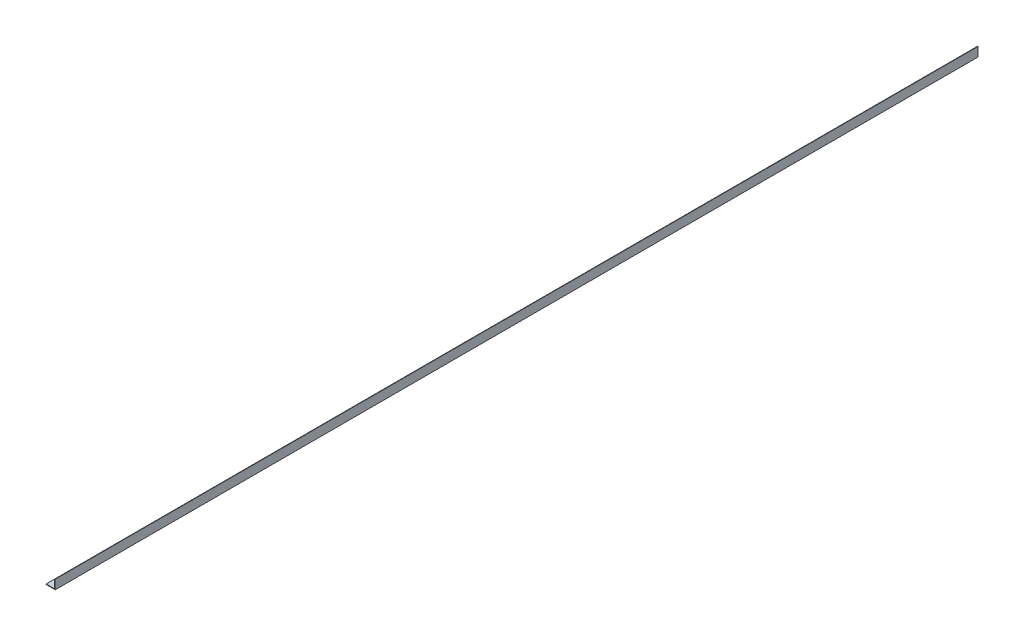
ISO-10303-21;
HEADER;
FILE_DESCRIPTION(('STEP AP214'),'2;1');
FILE_NAME('part.step','',(''),(''),'','','');
FILE_SCHEMA(('AUTOMOTIVE_DESIGN { 1 0 10303 214 1 1 1 1 }'));
ENDSEC;
DATA;
#1=APPLICATION_CONTEXT('core data for automotive mechanical design processes');
#2=APPLICATION_PROTOCOL_DEFINITION('international standard','automotive_design',2000,#1);
#3=PRODUCT_CONTEXT('',#1,'mechanical');
#4=PRODUCT('Part','Part','',(#3));
#5=PRODUCT_RELATED_PRODUCT_CATEGORY('part','',(#4));
#6=PRODUCT_DEFINITION_FORMATION('','',#4);
#7=PRODUCT_DEFINITION_CONTEXT('part definition',#1,'design');
#8=PRODUCT_DEFINITION('design','',#6,#7);
#9=PRODUCT_DEFINITION_SHAPE('','',#8);
#10=(LENGTH_UNIT() NAMED_UNIT(*) SI_UNIT(.MILLI.,.METRE.));
#11=(NAMED_UNIT(*) PLANE_ANGLE_UNIT() SI_UNIT($,.RADIAN.));
#12=(NAMED_UNIT(*) SI_UNIT($,.STERADIAN.) SOLID_ANGLE_UNIT());
#13=UNCERTAINTY_MEASURE_WITH_UNIT(LENGTH_MEASURE(1.E-05),#10,'distance_accuracy_value','');
#14=(GEOMETRIC_REPRESENTATION_CONTEXT(3) GLOBAL_UNCERTAINTY_ASSIGNED_CONTEXT((#13)) GLOBAL_UNIT_ASSIGNED_CONTEXT((#10,
#11,#12)) REPRESENTATION_CONTEXT('',''));
#15=CARTESIAN_POINT('',(0.,0.,0.));
#16=DIRECTION('',(0.,0.,1.));
#17=DIRECTION('',(1.,0.,0.));
#18=AXIS2_PLACEMENT_3D('',#15,#16,#17);
#19=CARTESIAN_POINT('',(-12.7,-11.90625,1270.));
#20=DIRECTION('',(1.,0.,0.));
#21=DIRECTION('',(0.,0.,-1.));
#22=AXIS2_PLACEMENT_3D('',#19,#20,#21);
#23=PLANE('',#22);
#24=DIRECTION('',(0.,-1.,0.));
#25=VECTOR('',#24,1.);
#26=CARTESIAN_POINT('',(-12.7,-11.90625,-1270.));
#27=LINE('',#26,#25);
#28=CARTESIAN_POINT('',(-12.7,-11.90625,-1270.));
#29=VERTEX_POINT('',#28);
#30=CARTESIAN_POINT('',(-12.7,-12.7,-1270.));
#31=VERTEX_POINT('',#30);
#32=EDGE_CURVE('E425',#29,#31,#27,.T.);
#33=ORIENTED_EDGE('',*,*,#32,.T.);
#34=DIRECTION('',(0.,0.,-1.));
#35=VECTOR('',#34,1.);
#36=CARTESIAN_POINT('',(-12.7,-12.7,1270.));
#37=LINE('',#36,#35);
#38=CARTESIAN_POINT('',(-12.7,-12.7,1270.));
#39=VERTEX_POINT('',#38);
#40=EDGE_CURVE('E11',#39,#31,#37,.T.);
#41=ORIENTED_EDGE('',*,*,#40,.F.);
#42=DIRECTION('',(0.,-1.,0.));
#43=VECTOR('',#42,1.);
#44=CARTESIAN_POINT('',(-12.7,-11.90625,1270.));
#45=LINE('',#44,#43);
#46=CARTESIAN_POINT('',(-12.7,-11.90625,1270.));
#47=VERTEX_POINT('',#46);
#48=EDGE_CURVE('E426',#47,#39,#45,.T.);
#49=ORIENTED_EDGE('',*,*,#48,.F.);
#50=DIRECTION('',(0.,0.,-1.));
#51=VECTOR('',#50,1.);
#52=CARTESIAN_POINT('',(-12.7,-11.90625,1270.));
#53=LINE('',#52,#51);
#54=EDGE_CURVE('E455',#47,#29,#53,.T.);
#55=ORIENTED_EDGE('',*,*,#54,.T.);
#56=EDGE_LOOP('',(#33,#41,#49,#55));
#57=FACE_BOUND('',#56,.T.);
#58=ADVANCED_FACE('F44',(#57),#23,.F.);
#59=CARTESIAN_POINT('',(-12.7,-12.7,1270.));
#60=DIRECTION('',(0.,1.,0.));
#61=DIRECTION('',(-1.,0.,0.));
#62=AXIS2_PLACEMENT_3D('',#59,#60,#61);
#63=PLANE('',#62);
#64=DIRECTION('',(0.,0.,1.));
#65=VECTOR('',#64,1.);
#66=CARTESIAN_POINT('',(-4.63550000000013,-12.7,-1057.275));
#67=LINE('',#66,#65);
#68=CARTESIAN_POINT('',(-4.63550000000013,-12.7,-1076.325));
#69=VERTEX_POINT('',#68);
#70=CARTESIAN_POINT('',(-4.63550000000013,-12.7,-1057.275));
#71=VERTEX_POINT('',#70);
#72=EDGE_CURVE('E224',#69,#71,#67,.T.);
#73=ORIENTED_EDGE('',*,*,#72,.T.);
#74=CARTESIAN_POINT('',(-1.58750000000013,-12.7,-1057.275));
#75=DIRECTION('',(0.,1.,0.));
#76=DIRECTION('',(0.,0.,1.));
#77=AXIS2_PLACEMENT_3D('',#74,#75,#76);
#78=CIRCLE('',#77,3.04800000000014);
#79=CARTESIAN_POINT('',(1.46050000000014,-12.7,-1057.275));
#80=VERTEX_POINT('',#79);
#81=EDGE_CURVE('E215',#71,#80,#78,.T.);
#82=ORIENTED_EDGE('',*,*,#81,.T.);
#83=DIRECTION('',(0.,0.,-1.));
#84=VECTOR('',#83,1.);
#85=CARTESIAN_POINT('',(1.46050000000014,-12.7,-1057.275));
#86=LINE('',#85,#84);
#87=CARTESIAN_POINT('',(1.46050000000014,-12.7,-1076.325));
#88=VERTEX_POINT('',#87);
#89=EDGE_CURVE('E227',#80,#88,#86,.T.);
#90=ORIENTED_EDGE('',*,*,#89,.T.);
#91=CARTESIAN_POINT('',(-1.58750000000013,-12.7,-1076.325));
#92=DIRECTION('',(0.,1.,0.));
#93=DIRECTION('',(0.,0.,1.));
#94=AXIS2_PLACEMENT_3D('',#91,#92,#93);
#95=CIRCLE('',#94,3.04800000000014);
#96=EDGE_CURVE('E59',#88,#69,#95,.T.);
#97=ORIENTED_EDGE('',*,*,#96,.T.);
#98=EDGE_LOOP('',(#73,#82,#90,#97));
#99=FACE_BOUND('',#98,.T.);
#100=DIRECTION('',(0.,0.,-1.));
#101=VECTOR('',#100,1.);
#102=CARTESIAN_POINT('',(1.46049999999992,-12.7,-660.4));
#103=LINE('',#102,#101);
#104=CARTESIAN_POINT('',(1.46049999999992,-12.7,-641.35));
#105=VERTEX_POINT('',#104);
#106=CARTESIAN_POINT('',(1.46049999999992,-12.7,-660.4));
#107=VERTEX_POINT('',#106);
#108=EDGE_CURVE('E276',#105,#107,#103,.T.);
#109=ORIENTED_EDGE('',*,*,#108,.T.);
#110=CARTESIAN_POINT('',(-1.58750000000008,-12.7,-660.4));
#111=DIRECTION('',(0.,1.,0.));
#112=DIRECTION('',(0.,0.,1.));
#113=AXIS2_PLACEMENT_3D('',#110,#111,#112);
#114=CIRCLE('',#113,3.048);
#115=CARTESIAN_POINT('',(-4.63550000000008,-12.7,-660.4));
#116=VERTEX_POINT('',#115);
#117=EDGE_CURVE('E265',#107,#116,#114,.T.);
#118=ORIENTED_EDGE('',*,*,#117,.T.);
#119=DIRECTION('',(0.,0.,1.));
#120=VECTOR('',#119,1.);
#121=CARTESIAN_POINT('',(-4.63550000000008,-12.7,-660.4));
#122=LINE('',#121,#120);
#123=CARTESIAN_POINT('',(-4.63550000000008,-12.7,-641.35));
#124=VERTEX_POINT('',#123);
#125=EDGE_CURVE('E269',#116,#124,#122,.T.);
#126=ORIENTED_EDGE('',*,*,#125,.T.);
#127=CARTESIAN_POINT('',(-1.58750000000008,-12.7,-641.35));
#128=DIRECTION('',(0.,1.,0.));
#129=DIRECTION('',(0.,0.,1.));
#130=AXIS2_PLACEMENT_3D('',#127,#128,#129);
#131=CIRCLE('',#130,3.048);
#132=EDGE_CURVE('E67',#124,#105,#131,.T.);
#133=ORIENTED_EDGE('',*,*,#132,.T.);
#134=EDGE_LOOP('',(#109,#118,#126,#133));
#135=FACE_BOUND('',#134,.T.);
#136=DIRECTION('',(0.,0.,1.));
#137=VECTOR('',#136,1.);
#138=CARTESIAN_POINT('',(-4.6355,-12.7,336.55));
#139=LINE('',#138,#137);
#140=CARTESIAN_POINT('',(-4.6355,-12.7,317.5));
#141=VERTEX_POINT('',#140);
#142=CARTESIAN_POINT('',(-4.6355,-12.7,336.55));
#143=VERTEX_POINT('',#142);
#144=EDGE_CURVE('E320',#141,#143,#139,.T.);
#145=ORIENTED_EDGE('',*,*,#144,.T.);
#146=CARTESIAN_POINT('',(-1.5875,-12.7,336.55));
#147=DIRECTION('',(0.,1.,0.));
#148=DIRECTION('',(0.,0.,-1.));
#149=AXIS2_PLACEMENT_3D('',#146,#147,#148);
#150=CIRCLE('',#149,3.048);
#151=CARTESIAN_POINT('',(1.4605,-12.7,336.55));
#152=VERTEX_POINT('',#151);
#153=EDGE_CURVE('E307',#143,#152,#150,.T.);
#154=ORIENTED_EDGE('',*,*,#153,.T.);
#155=DIRECTION('',(0.,0.,-1.));
#156=VECTOR('',#155,1.);
#157=CARTESIAN_POINT('',(1.4605,-12.7,336.55));
#158=LINE('',#157,#156);
#159=CARTESIAN_POINT('',(1.4605,-12.7,317.5));
#160=VERTEX_POINT('',#159);
#161=EDGE_CURVE('E311',#152,#160,#158,.T.);
#162=ORIENTED_EDGE('',*,*,#161,.T.);
#163=CARTESIAN_POINT('',(-1.5875,-12.7,317.5));
#164=DIRECTION('',(0.,1.,0.));
#165=DIRECTION('',(0.,0.,-1.));
#166=AXIS2_PLACEMENT_3D('',#163,#164,#165);
#167=CIRCLE('',#166,3.048);
#168=EDGE_CURVE('E316',#160,#141,#167,.T.);
#169=ORIENTED_EDGE('',*,*,#168,.T.);
#170=EDGE_LOOP('',(#145,#154,#162,#169));
#171=FACE_BOUND('',#170,.T.);
#172=DIRECTION('',(0.,0.,-1.));
#173=VECTOR('',#172,1.);
#174=CARTESIAN_POINT('',(1.4605,-12.7,717.55));
#175=LINE('',#174,#173);
#176=CARTESIAN_POINT('',(1.4605,-12.7,1092.2));
#177=VERTEX_POINT('',#176);
#178=CARTESIAN_POINT('',(1.4605,-12.7,717.55));
#179=VERTEX_POINT('',#178);
#180=EDGE_CURVE('E364',#177,#179,#175,.T.);
#181=ORIENTED_EDGE('',*,*,#180,.T.);
#182=CARTESIAN_POINT('',(-1.5875,-12.7,717.55));
#183=DIRECTION('',(0.,1.,0.));
#184=DIRECTION('',(0.,0.,-1.));
#185=AXIS2_PLACEMENT_3D('',#182,#183,#184);
#186=CIRCLE('',#185,3.048);
#187=CARTESIAN_POINT('',(-4.6355,-12.7,717.55));
#188=VERTEX_POINT('',#187);
#189=EDGE_CURVE('E351',#179,#188,#186,.T.);
#190=ORIENTED_EDGE('',*,*,#189,.T.);
#191=DIRECTION('',(0.,0.,1.));
#192=VECTOR('',#191,1.);
#193=CARTESIAN_POINT('',(-4.6355,-12.7,717.55));
#194=LINE('',#193,#192);
#195=CARTESIAN_POINT('',(-4.6355,-12.7,1092.2));
#196=VERTEX_POINT('',#195);
#197=EDGE_CURVE('E355',#188,#196,#194,.T.);
#198=ORIENTED_EDGE('',*,*,#197,.T.);
#199=CARTESIAN_POINT('',(-1.5875,-12.7,1092.2));
#200=DIRECTION('',(0.,1.,0.));
#201=DIRECTION('',(0.,0.,-1.));
#202=AXIS2_PLACEMENT_3D('',#199,#200,#201);
#203=CIRCLE('',#202,3.048);
#204=EDGE_CURVE('E360',#196,#177,#203,.T.);
#205=ORIENTED_EDGE('',*,*,#204,.T.);
#206=EDGE_LOOP('',(#181,#190,#198,#205));
#207=FACE_BOUND('',#206,.T.);
#208=CARTESIAN_POINT('',(-1.5875,-12.7,349.504));
#209=DIRECTION('',(0.,1.,0.));
#210=DIRECTION('',(0.,0.,1.));
#211=AXIS2_PLACEMENT_3D('',#208,#209,#210);
#212=CIRCLE('',#211,2.5527);
#213=CARTESIAN_POINT('',(-1.5875,-12.7,352.0567));
#214=VERTEX_POINT('',#213);
#215=EDGE_CURVE('E397',#214,#214,#212,.T.);
#216=ORIENTED_EDGE('',*,*,#215,.T.);
#217=EDGE_LOOP('',(#216));
#218=FACE_BOUND('',#217,.T.);
#219=CARTESIAN_POINT('',(-1.5875,-12.7,-106.172));
#220=DIRECTION('',(0.,1.,0.));
#221=DIRECTION('',(0.,0.,1.));
#222=AXIS2_PLACEMENT_3D('',#219,#220,#221);
#223=CIRCLE('',#222,2.5527);
#224=CARTESIAN_POINT('',(-1.5875,-12.7,-103.6193));
#225=VERTEX_POINT('',#224);
#226=EDGE_CURVE('E405',#225,#225,#223,.T.);
#227=ORIENTED_EDGE('',*,*,#226,.T.);
#228=EDGE_LOOP('',(#227));
#229=FACE_BOUND('',#228,.T.);
#230=CARTESIAN_POINT('',(-1.5875,-12.7,-1017.524));
#231=DIRECTION('',(0.,1.,0.));
#232=DIRECTION('',(0.,0.,1.));
#233=AXIS2_PLACEMENT_3D('',#230,#231,#232);
#234=CIRCLE('',#233,2.5527);
#235=CARTESIAN_POINT('',(-1.5875,-12.7,-1014.9713));
#236=VERTEX_POINT('',#235);
#237=EDGE_CURVE('E413',#236,#236,#234,.T.);
#238=ORIENTED_EDGE('',*,*,#237,.T.);
#239=EDGE_LOOP('',(#238));
#240=FACE_BOUND('',#239,.T.);
#241=CARTESIAN_POINT('',(-1.5875,-12.7,-561.848));
#242=DIRECTION('',(0.,1.,0.));
#243=DIRECTION('',(0.,0.,1.));
#244=AXIS2_PLACEMENT_3D('',#241,#242,#243);
#245=CIRCLE('',#244,2.5527);
#246=CARTESIAN_POINT('',(-1.5875,-12.7,-559.2953));
#247=VERTEX_POINT('',#246);
#248=EDGE_CURVE('E421',#247,#247,#245,.T.);
#249=ORIENTED_EDGE('',*,*,#248,.T.);
#250=EDGE_LOOP('',(#249));
#251=FACE_BOUND('',#250,.T.);
#252=DIRECTION('',(1.,0.,0.));
#253=VECTOR('',#252,1.);
#254=CARTESIAN_POINT('',(-12.7,-12.7,-1270.));
#255=LINE('',#254,#253);
#256=CARTESIAN_POINT('',(12.7,-12.7,-1270.));
#257=VERTEX_POINT('',#256);
#258=EDGE_CURVE('E459',#31,#257,#255,.T.);
#259=ORIENTED_EDGE('',*,*,#258,.T.);
#260=DIRECTION('',(0.,0.,-1.));
#261=VECTOR('',#260,1.);
#262=CARTESIAN_POINT('',(12.7,-12.7,1270.));
#263=LINE('',#262,#261);
#264=CARTESIAN_POINT('',(12.7,-12.7,1270.));
#265=VERTEX_POINT('',#264);
#266=EDGE_CURVE('E52',#265,#257,#263,.T.);
#267=ORIENTED_EDGE('',*,*,#266,.F.);
#268=DIRECTION('',(1.,0.,0.));
#269=VECTOR('',#268,1.);
#270=CARTESIAN_POINT('',(-12.7,-12.7,1270.));
#271=LINE('',#270,#269);
#272=EDGE_CURVE('E430',#39,#265,#271,.T.);
#273=ORIENTED_EDGE('',*,*,#272,.F.);
#274=ORIENTED_EDGE('',*,*,#40,.T.);
#275=EDGE_LOOP('',(#259,#267,#273,#274));
#276=FACE_BOUND('',#275,.T.);
#277=ADVANCED_FACE('F232',(#99,#135,#171,#207,#218,#229,#240,#251,#276),#63,.F.);
#278=CARTESIAN_POINT('',(12.7,-12.7,1270.));
#279=DIRECTION('',(-1.,0.,0.));
#280=DIRECTION('',(0.,-1.,0.));
#281=AXIS2_PLACEMENT_3D('',#278,#279,#280);
#282=PLANE('',#281);
#283=DIRECTION('',(0.,1.,0.));
#284=VECTOR('',#283,1.);
#285=CARTESIAN_POINT('',(12.7,-12.7,-1270.));
#286=LINE('',#285,#284);
#287=CARTESIAN_POINT('',(12.7,12.7,-1270.));
#288=VERTEX_POINT('',#287);
#289=EDGE_CURVE('E462',#257,#288,#286,.T.);
#290=ORIENTED_EDGE('',*,*,#289,.T.);
#291=DIRECTION('',(0.,0.,-1.));
#292=VECTOR('',#291,1.);
#293=CARTESIAN_POINT('',(12.7,12.7,1270.));
#294=LINE('',#293,#292);
#295=CARTESIAN_POINT('',(12.7,12.7,1270.));
#296=VERTEX_POINT('',#295);
#297=EDGE_CURVE('E505',#296,#288,#294,.T.);
#298=ORIENTED_EDGE('',*,*,#297,.F.);
#299=DIRECTION('',(0.,1.,0.));
#300=VECTOR('',#299,1.);
#301=CARTESIAN_POINT('',(12.7,-12.7,1270.));
#302=LINE('',#301,#300);
#303=EDGE_CURVE('E434',#265,#296,#302,.T.);
#304=ORIENTED_EDGE('',*,*,#303,.F.);
#305=ORIENTED_EDGE('',*,*,#266,.T.);
#306=EDGE_LOOP('',(#290,#298,#304,#305));
#307=FACE_BOUND('',#306,.T.);
#308=ADVANCED_FACE('F514',(#307),#282,.F.);
#309=CARTESIAN_POINT('',(11.90625,12.7,1270.));
#310=DIRECTION('',(0.,-1.,0.));
#311=DIRECTION('',(0.,0.,-1.));
#312=AXIS2_PLACEMENT_3D('',#309,#310,#311);
#313=PLANE('',#312);
#314=DIRECTION('',(-1.,0.,0.));
#315=VECTOR('',#314,1.);
#316=CARTESIAN_POINT('',(11.90625,12.7,-1270.));
#317=LINE('',#316,#315);
#318=CARTESIAN_POINT('',(11.90625,12.7,-1270.));
#319=VERTEX_POINT('',#318);
#320=EDGE_CURVE('E465',#288,#319,#317,.T.);
#321=ORIENTED_EDGE('',*,*,#320,.T.);
#322=DIRECTION('',(0.,0.,-1.));
#323=VECTOR('',#322,1.);
#324=CARTESIAN_POINT('',(11.90625,12.7,1270.));
#325=LINE('',#324,#323);
#326=CARTESIAN_POINT('',(11.90625,12.7,1270.));
#327=VERTEX_POINT('',#326);
#328=EDGE_CURVE('E501',#327,#319,#325,.T.);
#329=ORIENTED_EDGE('',*,*,#328,.F.);
#330=DIRECTION('',(-1.,0.,0.));
#331=VECTOR('',#330,1.);
#332=CARTESIAN_POINT('',(11.90625,12.7,1270.));
#333=LINE('',#332,#331);
#334=EDGE_CURVE('E437',#296,#327,#333,.T.);
#335=ORIENTED_EDGE('',*,*,#334,.F.);
#336=ORIENTED_EDGE('',*,*,#297,.T.);
#337=EDGE_LOOP('',(#321,#329,#335,#336));
#338=FACE_BOUND('',#337,.T.);
#339=ADVANCED_FACE('F525',(#338),#313,.F.);
#340=CARTESIAN_POINT('',(11.90625,11.90625,1270.));
#341=DIRECTION('',(0.,0.,-1.));
#342=DIRECTION('',(-1.,0.,0.));
#343=AXIS2_PLACEMENT_3D('',#340,#341,#342);
#344=CYLINDRICAL_SURFACE('',#343,0.793749999999998);
#345=CARTESIAN_POINT('',(11.90625,11.90625,-1270.));
#346=DIRECTION('',(0.,0.,1.));
#347=DIRECTION('',(-1.,0.,0.));
#348=AXIS2_PLACEMENT_3D('',#345,#346,#347);
#349=CIRCLE('',#348,0.793749999999998);
#350=CARTESIAN_POINT('',(11.1125,11.90625,-1270.));
#351=VERTEX_POINT('',#350);
#352=EDGE_CURVE('E468',#319,#351,#349,.T.);
#353=ORIENTED_EDGE('',*,*,#352,.T.);
#354=DIRECTION('',(0.,0.,-1.));
#355=VECTOR('',#354,1.);
#356=CARTESIAN_POINT('',(11.1125,11.90625,1270.));
#357=LINE('',#356,#355);
#358=CARTESIAN_POINT('',(11.1125,11.90625,1270.));
#359=VERTEX_POINT('',#358);
#360=EDGE_CURVE('E497',#359,#351,#357,.T.);
#361=ORIENTED_EDGE('',*,*,#360,.F.);
#362=CARTESIAN_POINT('',(11.90625,11.90625,1270.));
#363=DIRECTION('',(0.,0.,1.));
#364=DIRECTION('',(-1.,0.,0.));
#365=AXIS2_PLACEMENT_3D('',#362,#363,#364);
#366=CIRCLE('',#365,0.793749999999998);
#367=EDGE_CURVE('E440',#327,#359,#366,.T.);
#368=ORIENTED_EDGE('',*,*,#367,.F.);
#369=ORIENTED_EDGE('',*,*,#328,.T.);
#370=EDGE_LOOP('',(#353,#361,#368,#369));
#371=FACE_BOUND('',#370,.T.);
#372=ADVANCED_FACE('F529',(#371),#344,.T.);
#373=CARTESIAN_POINT('',(11.1125,11.90625,1270.));
#374=DIRECTION('',(1.,0.,0.));
#375=DIRECTION('',(0.,1.,0.));
#376=AXIS2_PLACEMENT_3D('',#373,#374,#375);
#377=PLANE('',#376);
#378=DIRECTION('',(0.,-1.,0.));
#379=VECTOR('',#378,1.);
#380=CARTESIAN_POINT('',(11.1125,11.90625,-1270.));
#381=LINE('',#380,#379);
#382=CARTESIAN_POINT('',(11.1125,-9.5377,-1270.));
#383=VERTEX_POINT('',#382);
#384=EDGE_CURVE('E471',#351,#383,#381,.T.);
#385=ORIENTED_EDGE('',*,*,#384,.T.);
#386=DIRECTION('',(0.,0.,-1.));
#387=VECTOR('',#386,1.);
#388=CARTESIAN_POINT('',(11.1125,-9.5377,1270.));
#389=LINE('',#388,#387);
#390=CARTESIAN_POINT('',(11.1125,-9.5377,1270.));
#391=VERTEX_POINT('',#390);
#392=EDGE_CURVE('E493',#391,#383,#389,.T.);
#393=ORIENTED_EDGE('',*,*,#392,.F.);
#394=DIRECTION('',(0.,-1.,0.));
#395=VECTOR('',#394,1.);
#396=CARTESIAN_POINT('',(11.1125,11.90625,1270.));
#397=LINE('',#396,#395);
#398=EDGE_CURVE('E443',#359,#391,#397,.T.);
#399=ORIENTED_EDGE('',*,*,#398,.F.);
#400=ORIENTED_EDGE('',*,*,#360,.T.);
#401=EDGE_LOOP('',(#385,#393,#399,#400));
#402=FACE_BOUND('',#401,.T.);
#403=ADVANCED_FACE('F554',(#402),#377,.F.);
#404=CARTESIAN_POINT('',(9.5377,-9.5377,1270.));
#405=DIRECTION('',(0.,0.,-1.));
#406=DIRECTION('',(-1.,0.,0.));
#407=AXIS2_PLACEMENT_3D('',#404,#405,#406);
#408=CYLINDRICAL_SURFACE('',#407,1.5748);
#409=CARTESIAN_POINT('',(9.5377,-9.5377,-1270.));
#410=DIRECTION('',(0.,0.,-1.));
#411=DIRECTION('',(-1.,0.,0.));
#412=AXIS2_PLACEMENT_3D('',#409,#410,#411);
#413=CIRCLE('',#412,1.5748);
#414=CARTESIAN_POINT('',(9.5377,-11.1125,-1270.));
#415=VERTEX_POINT('',#414);
#416=EDGE_CURVE('E474',#383,#415,#413,.T.);
#417=ORIENTED_EDGE('',*,*,#416,.T.);
#418=DIRECTION('',(0.,0.,-1.));
#419=VECTOR('',#418,1.);
#420=CARTESIAN_POINT('',(9.5377,-11.1125,1270.));
#421=LINE('',#420,#419);
#422=CARTESIAN_POINT('',(9.5377,-11.1125,1270.));
#423=VERTEX_POINT('',#422);
#424=EDGE_CURVE('E489',#423,#415,#421,.T.);
#425=ORIENTED_EDGE('',*,*,#424,.F.);
#426=CARTESIAN_POINT('',(9.5377,-9.5377,1270.));
#427=DIRECTION('',(0.,0.,-1.));
#428=DIRECTION('',(-1.,0.,0.));
#429=AXIS2_PLACEMENT_3D('',#426,#427,#428);
#430=CIRCLE('',#429,1.5748);
#431=EDGE_CURVE('E446',#391,#423,#430,.T.);
#432=ORIENTED_EDGE('',*,*,#431,.F.);
#433=ORIENTED_EDGE('',*,*,#392,.T.);
#434=EDGE_LOOP('',(#417,#425,#432,#433));
#435=FACE_BOUND('',#434,.T.);
#436=ADVANCED_FACE('F552',(#435),#408,.F.);
#437=CARTESIAN_POINT('',(9.5377,-11.1125,1270.));
#438=DIRECTION('',(0.,-1.,0.));
#439=DIRECTION('',(0.,0.,-1.));
#440=AXIS2_PLACEMENT_3D('',#437,#438,#439);
#441=PLANE('',#440);
#442=DIRECTION('',(0.,0.,-1.));
#443=VECTOR('',#442,1.);
#444=CARTESIAN_POINT('',(1.46050000000014,-11.1125,-1057.275));
#445=LINE('',#444,#443);
#446=CARTESIAN_POINT('',(1.46050000000014,-11.1125,-1057.275));
#447=VERTEX_POINT('',#446);
#448=CARTESIAN_POINT('',(1.4605,-11.1125,-1076.325));
#449=VERTEX_POINT('',#448);
#450=EDGE_CURVE('E249',#447,#449,#445,.T.);
#451=ORIENTED_EDGE('',*,*,#450,.F.);
#452=CARTESIAN_POINT('',(-1.58750000000013,-11.1125,-1057.275));
#453=DIRECTION('',(0.,1.,0.));
#454=DIRECTION('',(0.,0.,1.));
#455=AXIS2_PLACEMENT_3D('',#452,#453,#454);
#456=CIRCLE('',#455,3.04800000000014);
#457=CARTESIAN_POINT('',(-4.63550000000013,-11.1125,-1057.275));
#458=VERTEX_POINT('',#457);
#459=EDGE_CURVE('E218',#458,#447,#456,.T.);
#460=ORIENTED_EDGE('',*,*,#459,.F.);
#461=DIRECTION('',(0.,0.,1.));
#462=VECTOR('',#461,1.);
#463=CARTESIAN_POINT('',(-4.63550000000013,-11.1125,-1057.275));
#464=LINE('',#463,#462);
#465=CARTESIAN_POINT('',(-4.63550000000013,-11.1125,-1076.325));
#466=VERTEX_POINT('',#465);
#467=EDGE_CURVE('E236',#466,#458,#464,.T.);
#468=ORIENTED_EDGE('',*,*,#467,.F.);
#469=CARTESIAN_POINT('',(-1.58750000000013,-11.1125,-1076.325));
#470=DIRECTION('',(0.,1.,0.));
#471=DIRECTION('',(0.,0.,1.));
#472=AXIS2_PLACEMENT_3D('',#469,#470,#471);
#473=CIRCLE('',#472,3.04800000000014);
#474=EDGE_CURVE('E240',#449,#466,#473,.T.);
#475=ORIENTED_EDGE('',*,*,#474,.F.);
#476=EDGE_LOOP('',(#451,#460,#468,#475));
#477=FACE_BOUND('',#476,.T.);
#478=DIRECTION('',(0.,0.,1.));
#479=VECTOR('',#478,1.);
#480=CARTESIAN_POINT('',(-4.63550000000008,-11.1125,-660.4));
#481=LINE('',#480,#479);
#482=CARTESIAN_POINT('',(-4.63550000000008,-11.1125,-660.4));
#483=VERTEX_POINT('',#482);
#484=CARTESIAN_POINT('',(-4.63550000000008,-11.1125,-641.35));
#485=VERTEX_POINT('',#484);
#486=EDGE_CURVE('E284',#483,#485,#481,.T.);
#487=ORIENTED_EDGE('',*,*,#486,.F.);
#488=CARTESIAN_POINT('',(-1.58750000000008,-11.1125,-660.4));
#489=DIRECTION('',(0.,1.,0.));
#490=DIRECTION('',(0.,0.,1.));
#491=AXIS2_PLACEMENT_3D('',#488,#489,#490);
#492=CIRCLE('',#491,3.048);
#493=CARTESIAN_POINT('',(1.46049999999992,-11.1125,-660.4));
#494=VERTEX_POINT('',#493);
#495=EDGE_CURVE('E281',#494,#483,#492,.T.);
#496=ORIENTED_EDGE('',*,*,#495,.F.);
#497=DIRECTION('',(0.,0.,-1.));
#498=VECTOR('',#497,1.);
#499=CARTESIAN_POINT('',(1.46049999999992,-11.1125,-660.4));
#500=LINE('',#499,#498);
#501=CARTESIAN_POINT('',(1.46049999999992,-11.1125,-641.35));
#502=VERTEX_POINT('',#501);
#503=EDGE_CURVE('E270',#502,#494,#500,.T.);
#504=ORIENTED_EDGE('',*,*,#503,.F.);
#505=CARTESIAN_POINT('',(-1.58750000000008,-11.1125,-641.35));
#506=DIRECTION('',(0.,1.,0.));
#507=DIRECTION('',(0.,0.,1.));
#508=AXIS2_PLACEMENT_3D('',#505,#506,#507);
#509=CIRCLE('',#508,3.048);
#510=EDGE_CURVE('E289',#485,#502,#509,.T.);
#511=ORIENTED_EDGE('',*,*,#510,.F.);
#512=EDGE_LOOP('',(#487,#496,#504,#511));
#513=FACE_BOUND('',#512,.T.);
#514=DIRECTION('',(0.,0.,-1.));
#515=VECTOR('',#514,1.);
#516=CARTESIAN_POINT('',(1.4605,-11.1125,336.55));
#517=LINE('',#516,#515);
#518=CARTESIAN_POINT('',(1.4605,-11.1125,336.55));
#519=VERTEX_POINT('',#518);
#520=CARTESIAN_POINT('',(1.4605,-11.1125,317.5));
#521=VERTEX_POINT('',#520);
#522=EDGE_CURVE('E328',#519,#521,#517,.T.);
#523=ORIENTED_EDGE('',*,*,#522,.F.);
#524=CARTESIAN_POINT('',(-1.5875,-11.1125,336.55));
#525=DIRECTION('',(0.,1.,0.));
#526=DIRECTION('',(0.,0.,-1.));
#527=AXIS2_PLACEMENT_3D('',#524,#525,#526);
#528=CIRCLE('',#527,3.048);
#529=CARTESIAN_POINT('',(-4.6355,-11.1125,336.55));
#530=VERTEX_POINT('',#529);
#531=EDGE_CURVE('E325',#530,#519,#528,.T.);
#532=ORIENTED_EDGE('',*,*,#531,.F.);
#533=DIRECTION('',(0.,0.,1.));
#534=VECTOR('',#533,1.);
#535=CARTESIAN_POINT('',(-4.6355,-11.1125,336.55));
#536=LINE('',#535,#534);
#537=CARTESIAN_POINT('',(-4.6355,-11.1125,317.5));
#538=VERTEX_POINT('',#537);
#539=EDGE_CURVE('E312',#538,#530,#536,.T.);
#540=ORIENTED_EDGE('',*,*,#539,.F.);
#541=CARTESIAN_POINT('',(-1.5875,-11.1125,317.5));
#542=DIRECTION('',(0.,1.,0.));
#543=DIRECTION('',(0.,0.,-1.));
#544=AXIS2_PLACEMENT_3D('',#541,#542,#543);
#545=CIRCLE('',#544,3.048);
#546=EDGE_CURVE('E333',#521,#538,#545,.T.);
#547=ORIENTED_EDGE('',*,*,#546,.F.);
#548=EDGE_LOOP('',(#523,#532,#540,#547));
#549=FACE_BOUND('',#548,.T.);
#550=DIRECTION('',(0.,0.,1.));
#551=VECTOR('',#550,1.);
#552=CARTESIAN_POINT('',(-4.6355,-11.1125,717.55));
#553=LINE('',#552,#551);
#554=CARTESIAN_POINT('',(-4.6355,-11.1125,717.55));
#555=VERTEX_POINT('',#554);
#556=CARTESIAN_POINT('',(-4.6355,-11.1125,1092.2));
#557=VERTEX_POINT('',#556);
#558=EDGE_CURVE('E372',#555,#557,#553,.T.);
#559=ORIENTED_EDGE('',*,*,#558,.F.);
#560=CARTESIAN_POINT('',(-1.5875,-11.1125,717.55));
#561=DIRECTION('',(0.,1.,0.));
#562=DIRECTION('',(0.,0.,-1.));
#563=AXIS2_PLACEMENT_3D('',#560,#561,#562);
#564=CIRCLE('',#563,3.048);
#565=CARTESIAN_POINT('',(1.4605,-11.1125,717.55));
#566=VERTEX_POINT('',#565);
#567=EDGE_CURVE('E369',#566,#555,#564,.T.);
#568=ORIENTED_EDGE('',*,*,#567,.F.);
#569=DIRECTION('',(0.,0.,-1.));
#570=VECTOR('',#569,1.);
#571=CARTESIAN_POINT('',(1.4605,-11.1125,717.55));
#572=LINE('',#571,#570);
#573=CARTESIAN_POINT('',(1.4605,-11.1125,1092.2));
#574=VERTEX_POINT('',#573);
#575=EDGE_CURVE('E356',#574,#566,#572,.T.);
#576=ORIENTED_EDGE('',*,*,#575,.F.);
#577=CARTESIAN_POINT('',(-1.5875,-11.1125,1092.2));
#578=DIRECTION('',(0.,1.,0.));
#579=DIRECTION('',(0.,0.,-1.));
#580=AXIS2_PLACEMENT_3D('',#577,#578,#579);
#581=CIRCLE('',#580,3.048);
#582=EDGE_CURVE('E376',#557,#574,#581,.T.);
#583=ORIENTED_EDGE('',*,*,#582,.F.);
#584=EDGE_LOOP('',(#559,#568,#576,#583));
#585=FACE_BOUND('',#584,.T.);
#586=CARTESIAN_POINT('',(-1.5875,-11.1125,349.504));
#587=DIRECTION('',(0.,1.,0.));
#588=DIRECTION('',(0.,0.,1.));
#589=AXIS2_PLACEMENT_3D('',#586,#587,#588);
#590=CIRCLE('',#589,2.55269999999999);
#591=CARTESIAN_POINT('',(-1.5875,-11.1125,352.0567));
#592=VERTEX_POINT('',#591);
#593=EDGE_CURVE('E259',#592,#592,#590,.T.);
#594=ORIENTED_EDGE('',*,*,#593,.F.);
#595=EDGE_LOOP('',(#594));
#596=FACE_BOUND('',#595,.T.);
#597=CARTESIAN_POINT('',(-1.5875,-11.1125,-106.172));
#598=DIRECTION('',(0.,1.,0.));
#599=DIRECTION('',(0.,0.,1.));
#600=AXIS2_PLACEMENT_3D('',#597,#598,#599);
#601=CIRCLE('',#600,2.55269999999999);
#602=CARTESIAN_POINT('',(-1.5875,-11.1125,-103.6193));
#603=VERTEX_POINT('',#602);
#604=EDGE_CURVE('E401',#603,#603,#601,.T.);
#605=ORIENTED_EDGE('',*,*,#604,.F.);
#606=EDGE_LOOP('',(#605));
#607=FACE_BOUND('',#606,.T.);
#608=CARTESIAN_POINT('',(-1.5875,-11.1125,-1017.524));
#609=DIRECTION('',(0.,1.,0.));
#610=DIRECTION('',(0.,0.,1.));
#611=AXIS2_PLACEMENT_3D('',#608,#609,#610);
#612=CIRCLE('',#611,2.55269999999999);
#613=CARTESIAN_POINT('',(-1.5875,-11.1125,-1014.9713));
#614=VERTEX_POINT('',#613);
#615=EDGE_CURVE('E409',#614,#614,#612,.T.);
#616=ORIENTED_EDGE('',*,*,#615,.F.);
#617=EDGE_LOOP('',(#616));
#618=FACE_BOUND('',#617,.T.);
#619=CARTESIAN_POINT('',(-1.5875,-11.1125,-561.848));
#620=DIRECTION('',(0.,1.,0.));
#621=DIRECTION('',(0.,0.,1.));
#622=AXIS2_PLACEMENT_3D('',#619,#620,#621);
#623=CIRCLE('',#622,2.55269999999999);
#624=CARTESIAN_POINT('',(-1.5875,-11.1125,-559.2953));
#625=VERTEX_POINT('',#624);
#626=EDGE_CURVE('E417',#625,#625,#623,.T.);
#627=ORIENTED_EDGE('',*,*,#626,.F.);
#628=EDGE_LOOP('',(#627));
#629=FACE_BOUND('',#628,.T.);
#630=DIRECTION('',(-1.,0.,0.));
#631=VECTOR('',#630,1.);
#632=CARTESIAN_POINT('',(9.5377,-11.1125,-1270.));
#633=LINE('',#632,#631);
#634=CARTESIAN_POINT('',(-11.90625,-11.1125,-1270.));
#635=VERTEX_POINT('',#634);
#636=EDGE_CURVE('E477',#415,#635,#633,.T.);
#637=ORIENTED_EDGE('',*,*,#636,.T.);
#638=DIRECTION('',(0.,0.,-1.));
#639=VECTOR('',#638,1.);
#640=CARTESIAN_POINT('',(-11.90625,-11.1125,1270.));
#641=LINE('',#640,#639);
#642=CARTESIAN_POINT('',(-11.90625,-11.1125,1270.));
#643=VERTEX_POINT('',#642);
#644=EDGE_CURVE('E485',#643,#635,#641,.T.);
#645=ORIENTED_EDGE('',*,*,#644,.F.);
#646=DIRECTION('',(-1.,0.,0.));
#647=VECTOR('',#646,1.);
#648=CARTESIAN_POINT('',(9.5377,-11.1125,1270.));
#649=LINE('',#648,#647);
#650=EDGE_CURVE('E449',#423,#643,#649,.T.);
#651=ORIENTED_EDGE('',*,*,#650,.F.);
#652=ORIENTED_EDGE('',*,*,#424,.T.);
#653=EDGE_LOOP('',(#637,#645,#651,#652));
#654=FACE_BOUND('',#653,.T.);
#655=ADVANCED_FACE('F548',(#477,#513,#549,#585,#596,#607,#618,#629,#654),#441,.F.);
#656=CARTESIAN_POINT('',(-11.90625,-11.90625,1270.));
#657=DIRECTION('',(0.,0.,-1.));
#658=DIRECTION('',(-1.,0.,0.));
#659=AXIS2_PLACEMENT_3D('',#656,#657,#658);
#660=CYLINDRICAL_SURFACE('',#659,0.79375);
#661=CARTESIAN_POINT('',(-11.90625,-11.90625,-1270.));
#662=DIRECTION('',(0.,0.,1.));
#663=DIRECTION('',(-1.,0.,0.));
#664=AXIS2_PLACEMENT_3D('',#661,#662,#663);
#665=CIRCLE('',#664,0.79375);
#666=EDGE_CURVE('E431',#635,#29,#665,.T.);
#667=ORIENTED_EDGE('',*,*,#666,.T.);
#668=ORIENTED_EDGE('',*,*,#54,.F.);
#669=CARTESIAN_POINT('',(-11.90625,-11.90625,1270.));
#670=DIRECTION('',(0.,0.,1.));
#671=DIRECTION('',(-1.,0.,0.));
#672=AXIS2_PLACEMENT_3D('',#669,#670,#671);
#673=CIRCLE('',#672,0.79375);
#674=EDGE_CURVE('E452',#643,#47,#673,.T.);
#675=ORIENTED_EDGE('',*,*,#674,.F.);
#676=ORIENTED_EDGE('',*,*,#644,.T.);
#677=EDGE_LOOP('',(#667,#668,#675,#676));
#678=FACE_BOUND('',#677,.T.);
#679=ADVANCED_FACE('F543',(#678),#660,.T.);
#680=CARTESIAN_POINT('',(11.90625,11.90625,1270.));
#681=DIRECTION('',(0.,0.,-1.));
#682=DIRECTION('',(-1.,0.,0.));
#683=AXIS2_PLACEMENT_3D('',#680,#681,#682);
#684=PLANE('',#683);
#685=ORIENTED_EDGE('',*,*,#48,.T.);
#686=ORIENTED_EDGE('',*,*,#272,.T.);
#687=ORIENTED_EDGE('',*,*,#303,.T.);
#688=ORIENTED_EDGE('',*,*,#334,.T.);
#689=ORIENTED_EDGE('',*,*,#367,.T.);
#690=ORIENTED_EDGE('',*,*,#398,.T.);
#691=ORIENTED_EDGE('',*,*,#431,.T.);
#692=ORIENTED_EDGE('',*,*,#650,.T.);
#693=ORIENTED_EDGE('',*,*,#674,.T.);
#694=EDGE_LOOP('',(#685,#686,#687,#688,#689,#690,#691,#692,#693));
#695=FACE_BOUND('',#694,.T.);
#696=ADVANCED_FACE('F533',(#695),#684,.F.);
#697=CARTESIAN_POINT('',(11.90625,11.90625,-1270.));
#698=DIRECTION('',(0.,0.,-1.));
#699=DIRECTION('',(-1.,0.,0.));
#700=AXIS2_PLACEMENT_3D('',#697,#698,#699);
#701=PLANE('',#700);
#702=ORIENTED_EDGE('',*,*,#32,.F.);
#703=ORIENTED_EDGE('',*,*,#666,.F.);
#704=ORIENTED_EDGE('',*,*,#636,.F.);
#705=ORIENTED_EDGE('',*,*,#416,.F.);
#706=ORIENTED_EDGE('',*,*,#384,.F.);
#707=ORIENTED_EDGE('',*,*,#352,.F.);
#708=ORIENTED_EDGE('',*,*,#320,.F.);
#709=ORIENTED_EDGE('',*,*,#289,.F.);
#710=ORIENTED_EDGE('',*,*,#258,.F.);
#711=EDGE_LOOP('',(#702,#703,#704,#705,#706,#707,#708,#709,#710));
#712=FACE_BOUND('',#711,.T.);
#713=ADVANCED_FACE('F520',(#712),#701,.T.);
#714=CARTESIAN_POINT('',(-1.5875,-11.1125,-561.848));
#715=DIRECTION('',(0.,1.,0.));
#716=DIRECTION('',(0.,0.,1.));
#717=AXIS2_PLACEMENT_3D('',#714,#715,#716);
#718=CYLINDRICAL_SURFACE('',#717,2.55269999999999);
#719=ORIENTED_EDGE('',*,*,#248,.F.);
#720=EDGE_LOOP('',(#719));
#721=FACE_BOUND('',#720,.T.);
#722=ORIENTED_EDGE('',*,*,#626,.T.);
#723=EDGE_LOOP('',(#722));
#724=FACE_BOUND('',#723,.T.);
#725=ADVANCED_FACE('F626',(#721,#724),#718,.F.);
#726=CARTESIAN_POINT('',(-1.5875,-11.1125,-1017.524));
#727=DIRECTION('',(0.,1.,0.));
#728=DIRECTION('',(0.,0.,1.));
#729=AXIS2_PLACEMENT_3D('',#726,#727,#728);
#730=CYLINDRICAL_SURFACE('',#729,2.55269999999999);
#731=ORIENTED_EDGE('',*,*,#237,.F.);
#732=EDGE_LOOP('',(#731));
#733=FACE_BOUND('',#732,.T.);
#734=ORIENTED_EDGE('',*,*,#615,.T.);
#735=EDGE_LOOP('',(#734));
#736=FACE_BOUND('',#735,.T.);
#737=ADVANCED_FACE('F637',(#733,#736),#730,.F.);
#738=CARTESIAN_POINT('',(-1.5875,-11.1125,-106.172));
#739=DIRECTION('',(0.,1.,0.));
#740=DIRECTION('',(0.,0.,1.));
#741=AXIS2_PLACEMENT_3D('',#738,#739,#740);
#742=CYLINDRICAL_SURFACE('',#741,2.55269999999999);
#743=ORIENTED_EDGE('',*,*,#226,.F.);
#744=EDGE_LOOP('',(#743));
#745=FACE_BOUND('',#744,.T.);
#746=ORIENTED_EDGE('',*,*,#604,.T.);
#747=EDGE_LOOP('',(#746));
#748=FACE_BOUND('',#747,.T.);
#749=ADVANCED_FACE('F649',(#745,#748),#742,.F.);
#750=CARTESIAN_POINT('',(-1.5875,-11.1125,349.504));
#751=DIRECTION('',(0.,1.,0.));
#752=DIRECTION('',(0.,0.,1.));
#753=AXIS2_PLACEMENT_3D('',#750,#751,#752);
#754=CYLINDRICAL_SURFACE('',#753,2.55269999999999);
#755=ORIENTED_EDGE('',*,*,#215,.F.);
#756=EDGE_LOOP('',(#755));
#757=FACE_BOUND('',#756,.T.);
#758=ORIENTED_EDGE('',*,*,#593,.T.);
#759=EDGE_LOOP('',(#758));
#760=FACE_BOUND('',#759,.T.);
#761=ADVANCED_FACE('F661',(#757,#760),#754,.F.);
#762=CARTESIAN_POINT('',(-1.5875,-12.7,717.55));
#763=DIRECTION('',(0.,1.,0.));
#764=DIRECTION('',(0.,0.,1.));
#765=AXIS2_PLACEMENT_3D('',#762,#763,#764);
#766=CYLINDRICAL_SURFACE('',#765,3.048);
#767=ORIENTED_EDGE('',*,*,#567,.T.);
#768=DIRECTION('',(0.,1.,0.));
#769=VECTOR('',#768,1.);
#770=CARTESIAN_POINT('',(-4.6355,-12.7,717.55));
#771=LINE('',#770,#769);
#772=EDGE_CURVE('E368',#188,#555,#771,.T.);
#773=ORIENTED_EDGE('',*,*,#772,.F.);
#774=ORIENTED_EDGE('',*,*,#189,.F.);
#775=DIRECTION('',(0.,1.,0.));
#776=VECTOR('',#775,1.);
#777=CARTESIAN_POINT('',(1.4605,-12.7,717.55));
#778=LINE('',#777,#776);
#779=EDGE_CURVE('E329',#179,#566,#778,.T.);
#780=ORIENTED_EDGE('',*,*,#779,.T.);
#781=EDGE_LOOP('',(#767,#773,#774,#780));
#782=FACE_BOUND('',#781,.T.);
#783=ADVANCED_FACE('F671',(#782),#766,.F.);
#784=CARTESIAN_POINT('',(1.4605,-12.7,717.55));
#785=DIRECTION('',(1.,0.,0.));
#786=DIRECTION('',(0.,0.,-1.));
#787=AXIS2_PLACEMENT_3D('',#784,#785,#786);
#788=PLANE('',#787);
#789=ORIENTED_EDGE('',*,*,#575,.T.);
#790=ORIENTED_EDGE('',*,*,#779,.F.);
#791=ORIENTED_EDGE('',*,*,#180,.F.);
#792=DIRECTION('',(0.,1.,0.));
#793=VECTOR('',#792,1.);
#794=CARTESIAN_POINT('',(1.4605,-12.7,1092.2));
#795=LINE('',#794,#793);
#796=EDGE_CURVE('E385',#177,#574,#795,.T.);
#797=ORIENTED_EDGE('',*,*,#796,.T.);
#798=EDGE_LOOP('',(#789,#790,#791,#797));
#799=FACE_BOUND('',#798,.T.);
#800=ADVANCED_FACE('F698',(#799),#788,.F.);
#801=CARTESIAN_POINT('',(-1.5875,-12.7,1092.2));
#802=DIRECTION('',(0.,1.,0.));
#803=DIRECTION('',(0.,0.,1.));
#804=AXIS2_PLACEMENT_3D('',#801,#802,#803);
#805=CYLINDRICAL_SURFACE('',#804,3.048);
#806=ORIENTED_EDGE('',*,*,#582,.T.);
#807=ORIENTED_EDGE('',*,*,#796,.F.);
#808=ORIENTED_EDGE('',*,*,#204,.F.);
#809=DIRECTION('',(0.,1.,0.));
#810=VECTOR('',#809,1.);
#811=CARTESIAN_POINT('',(-4.6355,-12.7,1092.2));
#812=LINE('',#811,#810);
#813=EDGE_CURVE('E388',#196,#557,#812,.T.);
#814=ORIENTED_EDGE('',*,*,#813,.T.);
#815=EDGE_LOOP('',(#806,#807,#808,#814));
#816=FACE_BOUND('',#815,.T.);
#817=ADVANCED_FACE('F709',(#816),#805,.F.);
#818=CARTESIAN_POINT('',(-4.6355,-12.7,717.55));
#819=DIRECTION('',(-1.,0.,0.));
#820=DIRECTION('',(0.,0.,1.));
#821=AXIS2_PLACEMENT_3D('',#818,#819,#820);
#822=PLANE('',#821);
#823=ORIENTED_EDGE('',*,*,#558,.T.);
#824=ORIENTED_EDGE('',*,*,#813,.F.);
#825=ORIENTED_EDGE('',*,*,#197,.F.);
#826=ORIENTED_EDGE('',*,*,#772,.T.);
#827=EDGE_LOOP('',(#823,#824,#825,#826));
#828=FACE_BOUND('',#827,.T.);
#829=ADVANCED_FACE('F720',(#828),#822,.F.);
#830=CARTESIAN_POINT('',(-1.5875,-12.7,336.55));
#831=DIRECTION('',(0.,1.,0.));
#832=DIRECTION('',(0.,0.,1.));
#833=AXIS2_PLACEMENT_3D('',#830,#831,#832);
#834=CYLINDRICAL_SURFACE('',#833,3.048);
#835=ORIENTED_EDGE('',*,*,#531,.T.);
#836=DIRECTION('',(0.,1.,0.));
#837=VECTOR('',#836,1.);
#838=CARTESIAN_POINT('',(1.4605,-12.7,336.55));
#839=LINE('',#838,#837);
#840=EDGE_CURVE('E324',#152,#519,#839,.T.);
#841=ORIENTED_EDGE('',*,*,#840,.F.);
#842=ORIENTED_EDGE('',*,*,#153,.F.);
#843=DIRECTION('',(0.,1.,0.));
#844=VECTOR('',#843,1.);
#845=CARTESIAN_POINT('',(-4.6355,-12.7,336.55));
#846=LINE('',#845,#844);
#847=EDGE_CURVE('E285',#143,#530,#846,.T.);
#848=ORIENTED_EDGE('',*,*,#847,.T.);
#849=EDGE_LOOP('',(#835,#841,#842,#848));
#850=FACE_BOUND('',#849,.T.);
#851=ADVANCED_FACE('F731',(#850),#834,.F.);
#852=CARTESIAN_POINT('',(-4.6355,-12.7,336.55));
#853=DIRECTION('',(-1.,0.,0.));
#854=DIRECTION('',(0.,0.,1.));
#855=AXIS2_PLACEMENT_3D('',#852,#853,#854);
#856=PLANE('',#855);
#857=ORIENTED_EDGE('',*,*,#539,.T.);
#858=ORIENTED_EDGE('',*,*,#847,.F.);
#859=ORIENTED_EDGE('',*,*,#144,.F.);
#860=DIRECTION('',(0.,1.,0.));
#861=VECTOR('',#860,1.);
#862=CARTESIAN_POINT('',(-4.6355,-12.7,317.5));
#863=LINE('',#862,#861);
#864=EDGE_CURVE('E342',#141,#538,#863,.T.);
#865=ORIENTED_EDGE('',*,*,#864,.T.);
#866=EDGE_LOOP('',(#857,#858,#859,#865));
#867=FACE_BOUND('',#866,.T.);
#868=ADVANCED_FACE('F742',(#867),#856,.F.);
#869=CARTESIAN_POINT('',(-1.5875,-12.7,317.5));
#870=DIRECTION('',(0.,1.,0.));
#871=DIRECTION('',(0.,0.,1.));
#872=AXIS2_PLACEMENT_3D('',#869,#870,#871);
#873=CYLINDRICAL_SURFACE('',#872,3.048);
#874=ORIENTED_EDGE('',*,*,#546,.T.);
#875=ORIENTED_EDGE('',*,*,#864,.F.);
#876=ORIENTED_EDGE('',*,*,#168,.F.);
#877=DIRECTION('',(0.,1.,0.));
#878=VECTOR('',#877,1.);
#879=CARTESIAN_POINT('',(1.4605,-12.7,317.5));
#880=LINE('',#879,#878);
#881=EDGE_CURVE('E345',#160,#521,#880,.T.);
#882=ORIENTED_EDGE('',*,*,#881,.T.);
#883=EDGE_LOOP('',(#874,#875,#876,#882));
#884=FACE_BOUND('',#883,.T.);
#885=ADVANCED_FACE('F753',(#884),#873,.F.);
#886=CARTESIAN_POINT('',(1.4605,-12.7,336.55));
#887=DIRECTION('',(1.,0.,0.));
#888=DIRECTION('',(0.,0.,-1.));
#889=AXIS2_PLACEMENT_3D('',#886,#887,#888);
#890=PLANE('',#889);
#891=ORIENTED_EDGE('',*,*,#522,.T.);
#892=ORIENTED_EDGE('',*,*,#881,.F.);
#893=ORIENTED_EDGE('',*,*,#161,.F.);
#894=ORIENTED_EDGE('',*,*,#840,.T.);
#895=EDGE_LOOP('',(#891,#892,#893,#894));
#896=FACE_BOUND('',#895,.T.);
#897=ADVANCED_FACE('F764',(#896),#890,.F.);
#898=CARTESIAN_POINT('',(-1.58750000000008,-12.7,-660.4));
#899=DIRECTION('',(0.,1.,0.));
#900=DIRECTION('',(0.,0.,1.));
#901=AXIS2_PLACEMENT_3D('',#898,#899,#900);
#902=CYLINDRICAL_SURFACE('',#901,3.048);
#903=ORIENTED_EDGE('',*,*,#495,.T.);
#904=DIRECTION('',(0.,1.,0.));
#905=VECTOR('',#904,1.);
#906=CARTESIAN_POINT('',(-4.63550000000008,-12.7,-660.4));
#907=LINE('',#906,#905);
#908=EDGE_CURVE('E280',#116,#483,#907,.T.);
#909=ORIENTED_EDGE('',*,*,#908,.F.);
#910=ORIENTED_EDGE('',*,*,#117,.F.);
#911=DIRECTION('',(0.,1.,0.));
#912=VECTOR('',#911,1.);
#913=CARTESIAN_POINT('',(1.46049999999992,-12.7,-660.4));
#914=LINE('',#913,#912);
#915=EDGE_CURVE('E250',#107,#494,#914,.T.);
#916=ORIENTED_EDGE('',*,*,#915,.T.);
#917=EDGE_LOOP('',(#903,#909,#910,#916));
#918=FACE_BOUND('',#917,.T.);
#919=ADVANCED_FACE('F775',(#918),#902,.F.);
#920=CARTESIAN_POINT('',(1.46049999999992,-12.7,-660.4));
#921=DIRECTION('',(1.,0.,0.));
#922=DIRECTION('',(0.,0.,-1.));
#923=AXIS2_PLACEMENT_3D('',#920,#921,#922);
#924=PLANE('',#923);
#925=ORIENTED_EDGE('',*,*,#503,.T.);
#926=ORIENTED_EDGE('',*,*,#915,.F.);
#927=ORIENTED_EDGE('',*,*,#108,.F.);
#928=DIRECTION('',(0.,1.,0.));
#929=VECTOR('',#928,1.);
#930=CARTESIAN_POINT('',(1.46049999999992,-12.7,-641.35));
#931=LINE('',#930,#929);
#932=EDGE_CURVE('E298',#105,#502,#931,.T.);
#933=ORIENTED_EDGE('',*,*,#932,.T.);
#934=EDGE_LOOP('',(#925,#926,#927,#933));
#935=FACE_BOUND('',#934,.T.);
#936=ADVANCED_FACE('F786',(#935),#924,.F.);
#937=CARTESIAN_POINT('',(-1.58750000000008,-12.7,-641.35));
#938=DIRECTION('',(0.,1.,0.));
#939=DIRECTION('',(0.,0.,1.));
#940=AXIS2_PLACEMENT_3D('',#937,#938,#939);
#941=CYLINDRICAL_SURFACE('',#940,3.048);
#942=ORIENTED_EDGE('',*,*,#510,.T.);
#943=ORIENTED_EDGE('',*,*,#932,.F.);
#944=ORIENTED_EDGE('',*,*,#132,.F.);
#945=DIRECTION('',(0.,1.,0.));
#946=VECTOR('',#945,1.);
#947=CARTESIAN_POINT('',(-4.63550000000008,-12.7,-641.35));
#948=LINE('',#947,#946);
#949=EDGE_CURVE('E301',#124,#485,#948,.T.);
#950=ORIENTED_EDGE('',*,*,#949,.T.);
#951=EDGE_LOOP('',(#942,#943,#944,#950));
#952=FACE_BOUND('',#951,.T.);
#953=ADVANCED_FACE('F797',(#952),#941,.F.);
#954=CARTESIAN_POINT('',(-4.63550000000008,-12.7,-660.4));
#955=DIRECTION('',(-1.,0.,0.));
#956=DIRECTION('',(0.,0.,1.));
#957=AXIS2_PLACEMENT_3D('',#954,#955,#956);
#958=PLANE('',#957);
#959=ORIENTED_EDGE('',*,*,#486,.T.);
#960=ORIENTED_EDGE('',*,*,#949,.F.);
#961=ORIENTED_EDGE('',*,*,#125,.F.);
#962=ORIENTED_EDGE('',*,*,#908,.T.);
#963=EDGE_LOOP('',(#959,#960,#961,#962));
#964=FACE_BOUND('',#963,.T.);
#965=ADVANCED_FACE('F808',(#964),#958,.F.);
#966=CARTESIAN_POINT('',(-1.58750000000013,-12.7,-1057.275));
#967=DIRECTION('',(0.,1.,0.));
#968=DIRECTION('',(0.,0.,1.));
#969=AXIS2_PLACEMENT_3D('',#966,#967,#968);
#970=CYLINDRICAL_SURFACE('',#969,3.04800000000014);
#971=ORIENTED_EDGE('',*,*,#459,.T.);
#972=DIRECTION('',(0.,1.,0.));
#973=VECTOR('',#972,1.);
#974=CARTESIAN_POINT('',(1.46050000000014,-12.7,-1057.275));
#975=LINE('',#974,#973);
#976=EDGE_CURVE('E211',#80,#447,#975,.T.);
#977=ORIENTED_EDGE('',*,*,#976,.F.);
#978=ORIENTED_EDGE('',*,*,#81,.F.);
#979=DIRECTION('',(0.,1.,0.));
#980=VECTOR('',#979,1.);
#981=CARTESIAN_POINT('',(-4.63550000000013,-12.7,-1057.275));
#982=LINE('',#981,#980);
#983=EDGE_CURVE('E256',#71,#458,#982,.T.);
#984=ORIENTED_EDGE('',*,*,#983,.T.);
#985=EDGE_LOOP('',(#971,#977,#978,#984));
#986=FACE_BOUND('',#985,.T.);
#987=ADVANCED_FACE('F213',(#986),#970,.F.);
#988=CARTESIAN_POINT('',(-4.63550000000013,-12.7,-1057.275));
#989=DIRECTION('',(-1.,0.,0.));
#990=DIRECTION('',(0.,0.,1.));
#991=AXIS2_PLACEMENT_3D('',#988,#989,#990);
#992=PLANE('',#991);
#993=ORIENTED_EDGE('',*,*,#467,.T.);
#994=ORIENTED_EDGE('',*,*,#983,.F.);
#995=ORIENTED_EDGE('',*,*,#72,.F.);
#996=DIRECTION('',(0.,1.,0.));
#997=VECTOR('',#996,1.);
#998=CARTESIAN_POINT('',(-4.63550000000013,-12.7,-1076.325));
#999=LINE('',#998,#997);
#1000=EDGE_CURVE('E260',#69,#466,#999,.T.);
#1001=ORIENTED_EDGE('',*,*,#1000,.T.);
#1002=EDGE_LOOP('',(#993,#994,#995,#1001));
#1003=FACE_BOUND('',#1002,.T.);
#1004=ADVANCED_FACE('F828',(#1003),#992,.F.);
#1005=CARTESIAN_POINT('',(-1.58750000000013,-12.7,-1076.325));
#1006=DIRECTION('',(0.,1.,0.));
#1007=DIRECTION('',(0.,0.,1.));
#1008=AXIS2_PLACEMENT_3D('',#1005,#1006,#1007);
#1009=CYLINDRICAL_SURFACE('',#1008,3.04800000000014);
#1010=ORIENTED_EDGE('',*,*,#474,.T.);
#1011=ORIENTED_EDGE('',*,*,#1000,.F.);
#1012=ORIENTED_EDGE('',*,*,#96,.F.);
#1013=DIRECTION('',(0.,1.,0.));
#1014=VECTOR('',#1013,1.);
#1015=CARTESIAN_POINT('',(1.4605,-12.7,-1076.325));
#1016=LINE('',#1015,#1014);
#1017=EDGE_CURVE('E223',#88,#449,#1016,.T.);
#1018=ORIENTED_EDGE('',*,*,#1017,.T.);
#1019=EDGE_LOOP('',(#1010,#1011,#1012,#1018));
#1020=FACE_BOUND('',#1019,.T.);
#1021=ADVANCED_FACE('F838',(#1020),#1009,.F.);
#1022=CARTESIAN_POINT('',(1.46050000000014,-12.7,-1057.275));
#1023=DIRECTION('',(1.,0.,0.));
#1024=DIRECTION('',(0.,0.,-1.));
#1025=AXIS2_PLACEMENT_3D('',#1022,#1023,#1024);
#1026=PLANE('',#1025);
#1027=ORIENTED_EDGE('',*,*,#450,.T.);
#1028=ORIENTED_EDGE('',*,*,#1017,.F.);
#1029=ORIENTED_EDGE('',*,*,#89,.F.);
#1030=ORIENTED_EDGE('',*,*,#976,.T.);
#1031=EDGE_LOOP('',(#1027,#1028,#1029,#1030));
#1032=FACE_BOUND('',#1031,.T.);
#1033=ADVANCED_FACE('F228',(#1032),#1026,.F.);
#1034=CLOSED_SHELL('',(#58,#277,#308,#339,#372,#403,#436,#655,#679,#696,#713,#725,#737,#749,
#761,#783,#800,#817,#829,#851,#868,#885,#897,#919,#936,#953,#965,#987,#1004,#1021,#1033));
#1035=MANIFOLD_SOLID_BREP('B2',#1034);
#1036=ADVANCED_BREP_SHAPE_REPRESENTATION('',(#18,#1035),#14);
#1037=SHAPE_DEFINITION_REPRESENTATION(#9,#1036);
ENDSEC;
END-ISO-10303-21;
